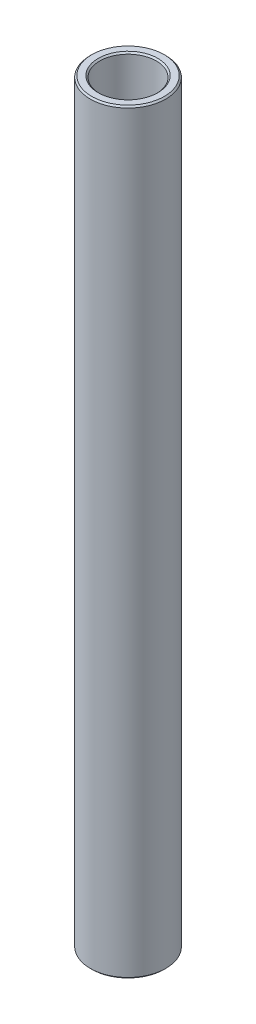
ISO-10303-21;
HEADER;
FILE_DESCRIPTION(('STEP AP214'),'2;1');
FILE_NAME('part.step','',(''),(''),'','','');
FILE_SCHEMA(('AUTOMOTIVE_DESIGN { 1 0 10303 214 1 1 1 1 }'));
ENDSEC;
DATA;
#1=APPLICATION_CONTEXT('core data for automotive mechanical design processes');
#2=APPLICATION_PROTOCOL_DEFINITION('international standard','automotive_design',2000,#1);
#3=PRODUCT_CONTEXT('',#1,'mechanical');
#4=PRODUCT('Part','Part','',(#3));
#5=PRODUCT_RELATED_PRODUCT_CATEGORY('part','',(#4));
#6=PRODUCT_DEFINITION_FORMATION('','',#4);
#7=PRODUCT_DEFINITION_CONTEXT('part definition',#1,'design');
#8=PRODUCT_DEFINITION('design','',#6,#7);
#9=PRODUCT_DEFINITION_SHAPE('','',#8);
#10=(LENGTH_UNIT() NAMED_UNIT(*) SI_UNIT(.MILLI.,.METRE.));
#11=(NAMED_UNIT(*) PLANE_ANGLE_UNIT() SI_UNIT($,.RADIAN.));
#12=(NAMED_UNIT(*) SI_UNIT($,.STERADIAN.) SOLID_ANGLE_UNIT());
#13=UNCERTAINTY_MEASURE_WITH_UNIT(LENGTH_MEASURE(1.E-05),#10,'distance_accuracy_value','');
#14=(GEOMETRIC_REPRESENTATION_CONTEXT(3) GLOBAL_UNCERTAINTY_ASSIGNED_CONTEXT((#13)) GLOBAL_UNIT_ASSIGNED_CONTEXT((#10,
#11,#12)) REPRESENTATION_CONTEXT('',''));
#15=CARTESIAN_POINT('',(0.,0.,0.));
#16=DIRECTION('',(0.,0.,1.));
#17=DIRECTION('',(1.,0.,0.));
#18=AXIS2_PLACEMENT_3D('',#15,#16,#17);
#19=CARTESIAN_POINT('',(6.35000000000029,70.6436949648144,0.));
#20=DIRECTION('',(0.,-1.,0.));
#21=DIRECTION('',(1.,0.,0.));
#22=AXIS2_PLACEMENT_3D('',#19,#20,#21);
#23=PLANE('',#22);
#24=CARTESIAN_POINT('',(0.,70.6436949648144,0.));
#25=DIRECTION('',(0.,-1.,0.));
#26=DIRECTION('',(1.,0.,0.));
#27=AXIS2_PLACEMENT_3D('',#24,#25,#26);
#28=CIRCLE('',#27,5.0165);
#29=CARTESIAN_POINT('',(5.0165,70.6436949648144,0.));
#30=VERTEX_POINT('',#29);
#31=EDGE_CURVE('E10',#30,#30,#28,.F.);
#32=ORIENTED_EDGE('',*,*,#31,.T.);
#33=EDGE_LOOP('',(#32));
#34=FACE_BOUND('',#33,.T.);
#35=CARTESIAN_POINT('',(0.,70.6436949648144,0.));
#36=DIRECTION('',(0.,-1.,0.));
#37=DIRECTION('',(1.,0.,0.));
#38=AXIS2_PLACEMENT_3D('',#35,#36,#37);
#39=CIRCLE('',#38,6.09600000000029);
#40=CARTESIAN_POINT('',(6.09600000000029,70.6436949648144,0.));
#41=VERTEX_POINT('',#40);
#42=EDGE_CURVE('E38',#41,#41,#39,.T.);
#43=ORIENTED_EDGE('',*,*,#42,.T.);
#44=EDGE_LOOP('',(#43));
#45=FACE_BOUND('',#44,.T.);
#46=ADVANCED_FACE('F31',(#34,#45),#23,.T.);
#47=CARTESIAN_POINT('',(0.,61.1186949648144,0.));
#48=DIRECTION('',(0.,-1.,0.));
#49=DIRECTION('',(1.,0.,0.));
#50=AXIS2_PLACEMENT_3D('',#47,#48,#49);
#51=CYLINDRICAL_SURFACE('',#50,4.76250000000006);
#52=CARTESIAN_POINT('',(0.,197.576828412298,0.));
#53=DIRECTION('',(0.,1.,0.));
#54=DIRECTION('',(-1.,0.,0.));
#55=AXIS2_PLACEMENT_3D('',#52,#53,#54);
#56=CIRCLE('',#55,4.76250000000006);
#57=CARTESIAN_POINT('',(-4.76250000000013,197.576828412298,0.));
#58=VERTEX_POINT('',#57);
#59=EDGE_CURVE('E42',#58,#58,#56,.T.);
#60=ORIENTED_EDGE('',*,*,#59,.T.);
#61=EDGE_LOOP('',(#60));
#62=FACE_BOUND('',#61,.T.);
#63=CARTESIAN_POINT('',(0.,70.8976949648143,0.));
#64=DIRECTION('',(0.,-1.,0.));
#65=DIRECTION('',(1.,0.,0.));
#66=AXIS2_PLACEMENT_3D('',#63,#64,#65);
#67=CIRCLE('',#66,4.76250000000006);
#68=CARTESIAN_POINT('',(4.76250000000005,70.8976949648143,0.));
#69=VERTEX_POINT('',#68);
#70=EDGE_CURVE('E46',#69,#69,#67,.T.);
#71=ORIENTED_EDGE('',*,*,#70,.T.);
#72=EDGE_LOOP('',(#71));
#73=FACE_BOUND('',#72,.T.);
#74=ADVANCED_FACE('F75',(#62,#73),#51,.F.);
#75=CARTESIAN_POINT('',(4.76250000000001,197.830828412298,0.));
#76=DIRECTION('',(0.,1.,0.));
#77=DIRECTION('',(-1.,0.,0.));
#78=AXIS2_PLACEMENT_3D('',#75,#76,#77);
#79=PLANE('',#78);
#80=CARTESIAN_POINT('',(0.,197.830828412298,0.));
#81=DIRECTION('',(0.,1.,0.));
#82=DIRECTION('',(-1.,0.,0.));
#83=AXIS2_PLACEMENT_3D('',#80,#81,#82);
#84=CIRCLE('',#83,6.09600000000039);
#85=CARTESIAN_POINT('',(-6.09600000000047,197.830828412298,0.));
#86=VERTEX_POINT('',#85);
#87=EDGE_CURVE('E51',#86,#86,#84,.T.);
#88=ORIENTED_EDGE('',*,*,#87,.T.);
#89=EDGE_LOOP('',(#88));
#90=FACE_BOUND('',#89,.T.);
#91=CARTESIAN_POINT('',(0.,197.830828412298,0.));
#92=DIRECTION('',(0.,1.,0.));
#93=DIRECTION('',(-1.,0.,0.));
#94=AXIS2_PLACEMENT_3D('',#91,#92,#93);
#95=CIRCLE('',#94,5.01650000000009);
#96=CARTESIAN_POINT('',(-5.01650000000016,197.830828412298,0.));
#97=VERTEX_POINT('',#96);
#98=EDGE_CURVE('E54',#97,#97,#95,.F.);
#99=ORIENTED_EDGE('',*,*,#98,.T.);
#100=EDGE_LOOP('',(#99));
#101=FACE_BOUND('',#100,.T.);
#102=ADVANCED_FACE('F80',(#90,#101),#79,.T.);
#103=CARTESIAN_POINT('',(0.,61.1186949648144,0.));
#104=DIRECTION('',(0.,-1.,0.));
#105=DIRECTION('',(1.,0.,0.));
#106=AXIS2_PLACEMENT_3D('',#103,#104,#105);
#107=CYLINDRICAL_SURFACE('',#106,6.35000000000033);
#108=CARTESIAN_POINT('',(0.,197.576828412298,0.));
#109=DIRECTION('',(0.,1.,0.));
#110=DIRECTION('',(-1.,0.,0.));
#111=AXIS2_PLACEMENT_3D('',#108,#109,#110);
#112=CIRCLE('',#111,6.35000000000033);
#113=CARTESIAN_POINT('',(-6.3500000000004,197.576828412298,0.));
#114=VERTEX_POINT('',#113);
#115=EDGE_CURVE('E57',#114,#114,#112,.F.);
#116=ORIENTED_EDGE('',*,*,#115,.T.);
#117=EDGE_LOOP('',(#116));
#118=FACE_BOUND('',#117,.T.);
#119=CARTESIAN_POINT('',(0.,70.8976949648144,0.));
#120=DIRECTION('',(0.,-1.,0.));
#121=DIRECTION('',(1.,0.,0.));
#122=AXIS2_PLACEMENT_3D('',#119,#120,#121);
#123=CIRCLE('',#122,6.35000000000033);
#124=CARTESIAN_POINT('',(6.35000000000032,70.8976949648144,0.));
#125=VERTEX_POINT('',#124);
#126=EDGE_CURVE('E60',#125,#125,#123,.F.);
#127=ORIENTED_EDGE('',*,*,#126,.T.);
#128=EDGE_LOOP('',(#127));
#129=FACE_BOUND('',#128,.T.);
#130=ADVANCED_FACE('F64',(#118,#129),#107,.T.);
#131=CARTESIAN_POINT('',(0.,197.576828412298,0.));
#132=DIRECTION('',(0.,-1.,0.));
#133=DIRECTION('',(1.,0.,0.));
#134=AXIS2_PLACEMENT_3D('',#131,#132,#133);
#135=CONICAL_SURFACE('',#134,6.35000000000033,0.785398163397479);
#136=ORIENTED_EDGE('',*,*,#87,.F.);
#137=EDGE_LOOP('',(#136));
#138=FACE_BOUND('',#137,.T.);
#139=ORIENTED_EDGE('',*,*,#115,.F.);
#140=EDGE_LOOP('',(#139));
#141=FACE_BOUND('',#140,.T.);
#142=ADVANCED_FACE('F85',(#138,#141),#135,.T.);
#143=CARTESIAN_POINT('',(0.,197.830828412298,0.));
#144=DIRECTION('',(0.,1.,0.));
#145=DIRECTION('',(-1.,0.,0.));
#146=AXIS2_PLACEMENT_3D('',#143,#144,#145);
#147=CONICAL_SURFACE('',#146,5.01650000000009,0.78539816339745);
#148=ORIENTED_EDGE('',*,*,#59,.F.);
#149=EDGE_LOOP('',(#148));
#150=FACE_BOUND('',#149,.T.);
#151=ORIENTED_EDGE('',*,*,#98,.F.);
#152=EDGE_LOOP('',(#151));
#153=FACE_BOUND('',#152,.T.);
#154=ADVANCED_FACE('F72',(#150,#153),#147,.F.);
#155=CARTESIAN_POINT('',(0.,70.8976949648143,0.));
#156=DIRECTION('',(0.,-1.,0.));
#157=DIRECTION('',(1.,0.,0.));
#158=AXIS2_PLACEMENT_3D('',#155,#156,#157);
#159=CONICAL_SURFACE('',#158,4.76250000000006,0.785398163397462);
#160=ORIENTED_EDGE('',*,*,#31,.F.);
#161=EDGE_LOOP('',(#160));
#162=FACE_BOUND('',#161,.T.);
#163=ORIENTED_EDGE('',*,*,#70,.F.);
#164=EDGE_LOOP('',(#163));
#165=FACE_BOUND('',#164,.T.);
#166=ADVANCED_FACE('F68',(#162,#165),#159,.F.);
#167=CARTESIAN_POINT('',(0.,70.6436949648144,0.));
#168=DIRECTION('',(0.,1.,0.));
#169=DIRECTION('',(-1.,0.,0.));
#170=AXIS2_PLACEMENT_3D('',#167,#168,#169);
#171=CONICAL_SURFACE('',#170,6.09600000000029,0.785398163397447);
#172=ORIENTED_EDGE('',*,*,#126,.F.);
#173=EDGE_LOOP('',(#172));
#174=FACE_BOUND('',#173,.T.);
#175=ORIENTED_EDGE('',*,*,#42,.F.);
#176=EDGE_LOOP('',(#175));
#177=FACE_BOUND('',#176,.T.);
#178=ADVANCED_FACE('F33',(#174,#177),#171,.T.);
#179=CLOSED_SHELL('',(#46,#74,#102,#130,#142,#154,#166,#178));
#180=MANIFOLD_SOLID_BREP('B2',#179);
#181=ADVANCED_BREP_SHAPE_REPRESENTATION('',(#18,#180),#14);
#182=SHAPE_DEFINITION_REPRESENTATION(#9,#181);
ENDSEC;
END-ISO-10303-21;
